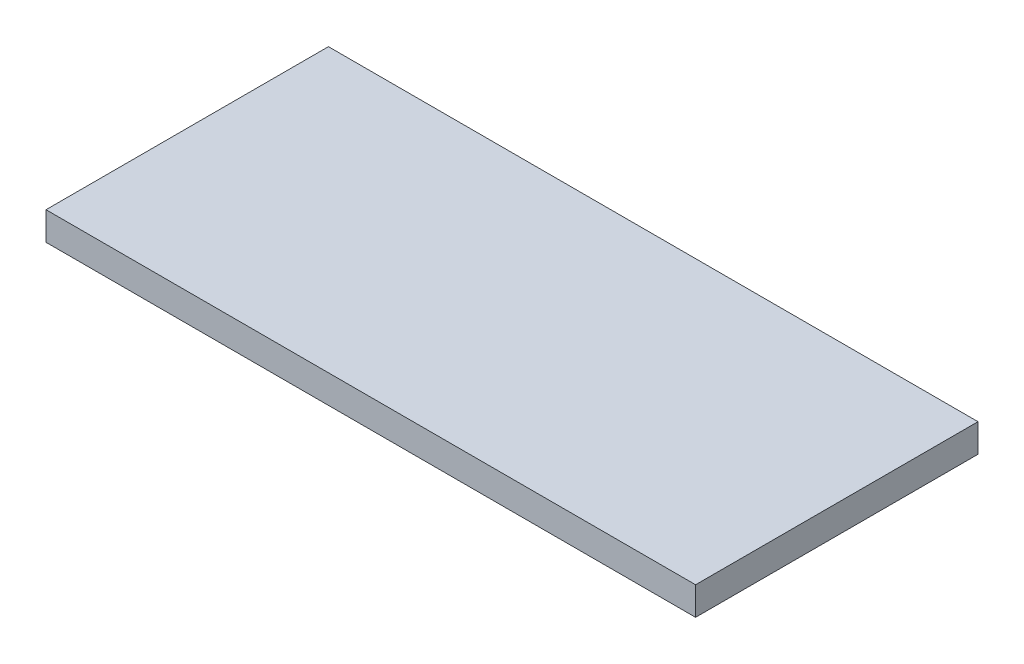
ISO-10303-21;
HEADER;
FILE_DESCRIPTION(('STEP AP214'),'2;1');
FILE_NAME('part.step','',(''),(''),'','','');
FILE_SCHEMA(('AUTOMOTIVE_DESIGN { 1 0 10303 214 1 1 1 1 }'));
ENDSEC;
DATA;
#1=APPLICATION_CONTEXT('core data for automotive mechanical design processes');
#2=APPLICATION_PROTOCOL_DEFINITION('international standard','automotive_design',2000,#1);
#3=PRODUCT_CONTEXT('',#1,'mechanical');
#4=PRODUCT('Part','Part','',(#3));
#5=PRODUCT_RELATED_PRODUCT_CATEGORY('part','',(#4));
#6=PRODUCT_DEFINITION_FORMATION('','',#4);
#7=PRODUCT_DEFINITION_CONTEXT('part definition',#1,'design');
#8=PRODUCT_DEFINITION('design','',#6,#7);
#9=PRODUCT_DEFINITION_SHAPE('','',#8);
#10=(LENGTH_UNIT() NAMED_UNIT(*) SI_UNIT(.MILLI.,.METRE.));
#11=(NAMED_UNIT(*) PLANE_ANGLE_UNIT() SI_UNIT($,.RADIAN.));
#12=(NAMED_UNIT(*) SI_UNIT($,.STERADIAN.) SOLID_ANGLE_UNIT());
#13=UNCERTAINTY_MEASURE_WITH_UNIT(LENGTH_MEASURE(1.E-05),#10,'distance_accuracy_value','');
#14=(GEOMETRIC_REPRESENTATION_CONTEXT(3) GLOBAL_UNCERTAINTY_ASSIGNED_CONTEXT((#13)) GLOBAL_UNIT_ASSIGNED_CONTEXT((#10,
#11,#12)) REPRESENTATION_CONTEXT('',''));
#15=CARTESIAN_POINT('',(0.,0.,0.));
#16=DIRECTION('',(0.,0.,1.));
#17=DIRECTION('',(1.,0.,0.));
#18=AXIS2_PLACEMENT_3D('',#15,#16,#17);
#19=CARTESIAN_POINT('',(0.,5.,0.));
#20=DIRECTION('',(-1.,0.,0.));
#21=DIRECTION('',(0.,0.,1.));
#22=AXIS2_PLACEMENT_3D('',#19,#20,#21);
#23=PLANE('',#22);
#24=DIRECTION('',(0.,0.,-1.));
#25=VECTOR('',#24,1.);
#26=CARTESIAN_POINT('',(0.,0.,0.));
#27=LINE('',#26,#25);
#28=CARTESIAN_POINT('',(0.,0.,0.));
#29=VERTEX_POINT('',#28);
#30=CARTESIAN_POINT('',(0.,0.,-50.));
#31=VERTEX_POINT('',#30);
#32=EDGE_CURVE('E101',#29,#31,#27,.T.);
#33=ORIENTED_EDGE('',*,*,#32,.F.);
#34=DIRECTION('',(0.,-1.,0.));
#35=VECTOR('',#34,1.);
#36=CARTESIAN_POINT('',(0.,5.,0.));
#37=LINE('',#36,#35);
#38=CARTESIAN_POINT('',(0.,5.,0.));
#39=VERTEX_POINT('',#38);
#40=EDGE_CURVE('E11',#39,#29,#37,.T.);
#41=ORIENTED_EDGE('',*,*,#40,.F.);
#42=DIRECTION('',(0.,0.,-1.));
#43=VECTOR('',#42,1.);
#44=CARTESIAN_POINT('',(0.,5.,0.));
#45=LINE('',#44,#43);
#46=CARTESIAN_POINT('',(0.,5.,-50.));
#47=VERTEX_POINT('',#46);
#48=EDGE_CURVE('E96',#39,#47,#45,.T.);
#49=ORIENTED_EDGE('',*,*,#48,.T.);
#50=DIRECTION('',(0.,-1.,0.));
#51=VECTOR('',#50,1.);
#52=CARTESIAN_POINT('',(0.,5.,-50.));
#53=LINE('',#52,#51);
#54=EDGE_CURVE('E39',#47,#31,#53,.T.);
#55=ORIENTED_EDGE('',*,*,#54,.T.);
#56=EDGE_LOOP('',(#33,#41,#49,#55));
#57=FACE_BOUND('',#56,.T.);
#58=ADVANCED_FACE('F36',(#57),#23,.T.);
#59=CARTESIAN_POINT('',(0.,5.,0.));
#60=DIRECTION('',(0.,0.,-1.));
#61=DIRECTION('',(-1.,0.,0.));
#62=AXIS2_PLACEMENT_3D('',#59,#60,#61);
#63=PLANE('',#62);
#64=DIRECTION('',(1.,0.,0.));
#65=VECTOR('',#64,1.);
#66=CARTESIAN_POINT('',(0.,0.,0.));
#67=LINE('',#66,#65);
#68=CARTESIAN_POINT('',(115.,0.,0.));
#69=VERTEX_POINT('',#68);
#70=EDGE_CURVE('E69',#29,#69,#67,.T.);
#71=ORIENTED_EDGE('',*,*,#70,.T.);
#72=DIRECTION('',(0.,-1.,0.));
#73=VECTOR('',#72,1.);
#74=CARTESIAN_POINT('',(115.,5.,0.));
#75=LINE('',#74,#73);
#76=CARTESIAN_POINT('',(115.,5.,0.));
#77=VERTEX_POINT('',#76);
#78=EDGE_CURVE('E45',#77,#69,#75,.T.);
#79=ORIENTED_EDGE('',*,*,#78,.F.);
#80=DIRECTION('',(1.,0.,0.));
#81=VECTOR('',#80,1.);
#82=CARTESIAN_POINT('',(0.,5.,0.));
#83=LINE('',#82,#81);
#84=EDGE_CURVE('E86',#39,#77,#83,.T.);
#85=ORIENTED_EDGE('',*,*,#84,.F.);
#86=ORIENTED_EDGE('',*,*,#40,.T.);
#87=EDGE_LOOP('',(#71,#79,#85,#86));
#88=FACE_BOUND('',#87,.T.);
#89=ADVANCED_FACE('F111',(#88),#63,.F.);
#90=CARTESIAN_POINT('',(115.,5.,0.));
#91=DIRECTION('',(-1.,0.,0.));
#92=DIRECTION('',(0.,0.,1.));
#93=AXIS2_PLACEMENT_3D('',#90,#91,#92);
#94=PLANE('',#93);
#95=DIRECTION('',(0.,0.,-1.));
#96=VECTOR('',#95,1.);
#97=CARTESIAN_POINT('',(115.,0.,0.));
#98=LINE('',#97,#96);
#99=CARTESIAN_POINT('',(115.,0.,-50.));
#100=VERTEX_POINT('',#99);
#101=EDGE_CURVE('E93',#69,#100,#98,.T.);
#102=ORIENTED_EDGE('',*,*,#101,.T.);
#103=DIRECTION('',(0.,-1.,0.));
#104=VECTOR('',#103,1.);
#105=CARTESIAN_POINT('',(115.,5.,-50.));
#106=LINE('',#105,#104);
#107=CARTESIAN_POINT('',(115.,5.,-50.));
#108=VERTEX_POINT('',#107);
#109=EDGE_CURVE('E90',#108,#100,#106,.T.);
#110=ORIENTED_EDGE('',*,*,#109,.F.);
#111=DIRECTION('',(0.,0.,-1.));
#112=VECTOR('',#111,1.);
#113=CARTESIAN_POINT('',(115.,5.,0.));
#114=LINE('',#113,#112);
#115=EDGE_CURVE('E81',#77,#108,#114,.T.);
#116=ORIENTED_EDGE('',*,*,#115,.F.);
#117=ORIENTED_EDGE('',*,*,#78,.T.);
#118=EDGE_LOOP('',(#102,#110,#116,#117));
#119=FACE_BOUND('',#118,.T.);
#120=ADVANCED_FACE('F91',(#119),#94,.F.);
#121=CARTESIAN_POINT('',(0.,5.,-50.));
#122=DIRECTION('',(0.,0.,-1.));
#123=DIRECTION('',(-1.,0.,0.));
#124=AXIS2_PLACEMENT_3D('',#121,#122,#123);
#125=PLANE('',#124);
#126=DIRECTION('',(1.,0.,0.));
#127=VECTOR('',#126,1.);
#128=CARTESIAN_POINT('',(0.,0.,-50.));
#129=LINE('',#128,#127);
#130=EDGE_CURVE('E104',#31,#100,#129,.T.);
#131=ORIENTED_EDGE('',*,*,#130,.F.);
#132=ORIENTED_EDGE('',*,*,#54,.F.);
#133=DIRECTION('',(1.,0.,0.));
#134=VECTOR('',#133,1.);
#135=CARTESIAN_POINT('',(0.,5.,-50.));
#136=LINE('',#135,#134);
#137=EDGE_CURVE('E85',#47,#108,#136,.T.);
#138=ORIENTED_EDGE('',*,*,#137,.T.);
#139=ORIENTED_EDGE('',*,*,#109,.T.);
#140=EDGE_LOOP('',(#131,#132,#138,#139));
#141=FACE_BOUND('',#140,.T.);
#142=ADVANCED_FACE('F95',(#141),#125,.T.);
#143=CARTESIAN_POINT('',(0.,5.,0.));
#144=DIRECTION('',(0.,-1.,0.));
#145=DIRECTION('',(0.,0.,-1.));
#146=AXIS2_PLACEMENT_3D('',#143,#144,#145);
#147=PLANE('',#146);
#148=ORIENTED_EDGE('',*,*,#48,.F.);
#149=ORIENTED_EDGE('',*,*,#84,.T.);
#150=ORIENTED_EDGE('',*,*,#115,.T.);
#151=ORIENTED_EDGE('',*,*,#137,.F.);
#152=EDGE_LOOP('',(#148,#149,#150,#151));
#153=FACE_BOUND('',#152,.T.);
#154=ADVANCED_FACE('F84',(#153),#147,.F.);
#155=CARTESIAN_POINT('',(0.,0.,0.));
#156=DIRECTION('',(0.,-1.,0.));
#157=DIRECTION('',(0.,0.,-1.));
#158=AXIS2_PLACEMENT_3D('',#155,#156,#157);
#159=PLANE('',#158);
#160=ORIENTED_EDGE('',*,*,#32,.T.);
#161=ORIENTED_EDGE('',*,*,#130,.T.);
#162=ORIENTED_EDGE('',*,*,#101,.F.);
#163=ORIENTED_EDGE('',*,*,#70,.F.);
#164=EDGE_LOOP('',(#160,#161,#162,#163));
#165=FACE_BOUND('',#164,.T.);
#166=ADVANCED_FACE('F109',(#165),#159,.T.);
#167=CLOSED_SHELL('',(#58,#89,#120,#142,#154,#166));
#168=MANIFOLD_SOLID_BREP('B2',#167);
#169=ADVANCED_BREP_SHAPE_REPRESENTATION('',(#18,#168),#14);
#170=SHAPE_DEFINITION_REPRESENTATION(#9,#169);
ENDSEC;
END-ISO-10303-21;
